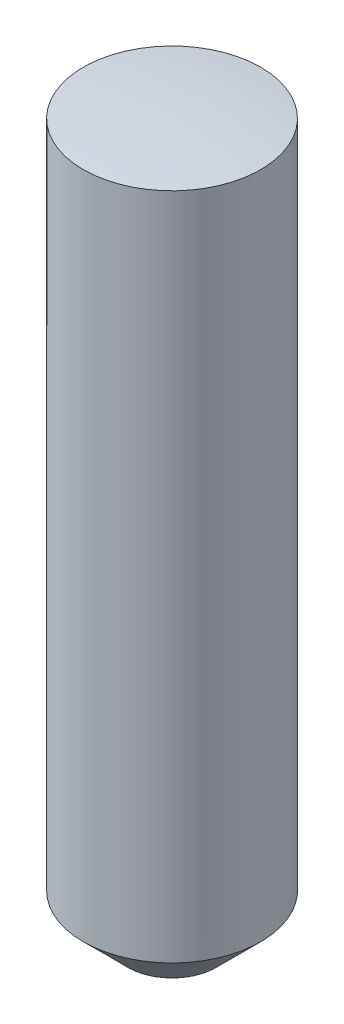
ISO-10303-21;
HEADER;
FILE_DESCRIPTION(('STEP AP214'),'2;1');
FILE_NAME('part.step','',(''),(''),'','','');
FILE_SCHEMA(('AUTOMOTIVE_DESIGN { 1 0 10303 214 1 1 1 1 }'));
ENDSEC;
DATA;
#1=APPLICATION_CONTEXT('core data for automotive mechanical design processes');
#2=APPLICATION_PROTOCOL_DEFINITION('international standard','automotive_design',2000,#1);
#3=PRODUCT_CONTEXT('',#1,'mechanical');
#4=PRODUCT('Part','Part','',(#3));
#5=PRODUCT_RELATED_PRODUCT_CATEGORY('part','',(#4));
#6=PRODUCT_DEFINITION_FORMATION('','',#4);
#7=PRODUCT_DEFINITION_CONTEXT('part definition',#1,'design');
#8=PRODUCT_DEFINITION('design','',#6,#7);
#9=PRODUCT_DEFINITION_SHAPE('','',#8);
#10=(LENGTH_UNIT() NAMED_UNIT(*) SI_UNIT(.MILLI.,.METRE.));
#11=(NAMED_UNIT(*) PLANE_ANGLE_UNIT() SI_UNIT($,.RADIAN.));
#12=(NAMED_UNIT(*) SI_UNIT($,.STERADIAN.) SOLID_ANGLE_UNIT());
#13=UNCERTAINTY_MEASURE_WITH_UNIT(LENGTH_MEASURE(1.E-05),#10,'distance_accuracy_value','');
#14=(GEOMETRIC_REPRESENTATION_CONTEXT(3) GLOBAL_UNCERTAINTY_ASSIGNED_CONTEXT((#13)) GLOBAL_UNIT_ASSIGNED_CONTEXT((#10,
#11,#12)) REPRESENTATION_CONTEXT('',''));
#15=CARTESIAN_POINT('',(0.,0.,0.));
#16=DIRECTION('',(0.,0.,1.));
#17=DIRECTION('',(1.,0.,0.));
#18=AXIS2_PLACEMENT_3D('',#15,#16,#17);
#19=CARTESIAN_POINT('',(0.,-8.1,0.));
#20=DIRECTION('',(0.,1.,0.));
#21=DIRECTION('',(0.,0.,1.));
#22=AXIS2_PLACEMENT_3D('',#19,#20,#21);
#23=PLANE('',#22);
#24=CARTESIAN_POINT('',(0.,-8.1000000000131,0.));
#25=DIRECTION('',(0.,1.,0.));
#26=DIRECTION('',(-1.,0.,0.));
#27=AXIS2_PLACEMENT_3D('',#24,#25,#26);
#28=CIRCLE('',#27,0.499999999988177);
#29=CARTESIAN_POINT('',(-0.499999999988176,-8.1000000000131,0.));
#30=VERTEX_POINT('',#29);
#31=EDGE_CURVE('E18',#30,#30,#28,.T.);
#32=ORIENTED_EDGE('',*,*,#31,.F.);
#33=EDGE_LOOP('',(#32));
#34=FACE_BOUND('',#33,.T.);
#35=ADVANCED_FACE('F15',(#34),#23,.F.);
#36=CARTESIAN_POINT('',(0.,-7.60000000013861,0.));
#37=DIRECTION('',(0.,1.,0.));
#38=DIRECTION('',(-1.,0.,0.));
#39=AXIS2_PLACEMENT_3D('',#36,#37,#38);
#40=CONICAL_SURFACE('',#39,0.999999999862666,0.785398163397448);
#41=CARTESIAN_POINT('',(0.,-7.6,0.));
#42=DIRECTION('',(0.,1.,0.));
#43=DIRECTION('',(0.,0.,1.));
#44=AXIS2_PLACEMENT_3D('',#41,#42,#43);
#45=CIRCLE('',#44,1.);
#46=CARTESIAN_POINT('',(0.,-7.6,1.));
#47=VERTEX_POINT('',#46);
#48=EDGE_CURVE('E22',#47,#47,#45,.T.);
#49=ORIENTED_EDGE('',*,*,#48,.F.);
#50=EDGE_LOOP('',(#49));
#51=FACE_BOUND('',#50,.T.);
#52=ORIENTED_EDGE('',*,*,#31,.T.);
#53=EDGE_LOOP('',(#52));
#54=FACE_BOUND('',#53,.T.);
#55=ADVANCED_FACE('F34',(#51,#54),#40,.T.);
#56=CARTESIAN_POINT('',(0.,-8.,0.));
#57=DIRECTION('',(-1.,0.,0.));
#58=DIRECTION('',(0.,1.,0.));
#59=AXIS2_PLACEMENT_3D('',#56,#57,#58);
#60=SPHERICAL_SURFACE('',#59,8.);
#61=CARTESIAN_POINT('',(0.,-0.0627460668062279,0.));
#62=DIRECTION('',(0.,1.,0.));
#63=DIRECTION('',(0.,0.,1.));
#64=AXIS2_PLACEMENT_3D('',#61,#62,#63);
#65=CIRCLE('',#64,1.);
#66=CARTESIAN_POINT('',(0.,-0.0627460668062279,1.));
#67=VERTEX_POINT('',#66);
#68=EDGE_CURVE('E10',#67,#67,#65,.F.);
#69=ORIENTED_EDGE('',*,*,#68,.F.);
#70=EDGE_LOOP('',(#69));
#71=FACE_BOUND('',#70,.T.);
#72=ADVANCED_FACE('F30',(#71),#60,.T.);
#73=CARTESIAN_POINT('',(0.,-8.1,0.));
#74=DIRECTION('',(0.,1.,0.));
#75=DIRECTION('',(0.,0.,1.));
#76=AXIS2_PLACEMENT_3D('',#73,#74,#75);
#77=CYLINDRICAL_SURFACE('',#76,1.);
#78=ORIENTED_EDGE('',*,*,#68,.T.);
#79=EDGE_LOOP('',(#78));
#80=FACE_BOUND('',#79,.T.);
#81=ORIENTED_EDGE('',*,*,#48,.T.);
#82=EDGE_LOOP('',(#81));
#83=FACE_BOUND('',#82,.T.);
#84=ADVANCED_FACE('F33',(#80,#83),#77,.T.);
#85=CLOSED_SHELL('',(#35,#55,#72,#84));
#86=MANIFOLD_SOLID_BREP('B1',#85);
#87=ADVANCED_BREP_SHAPE_REPRESENTATION('',(#18,#86),#14);
#88=SHAPE_DEFINITION_REPRESENTATION(#9,#87);
ENDSEC;
END-ISO-10303-21;
